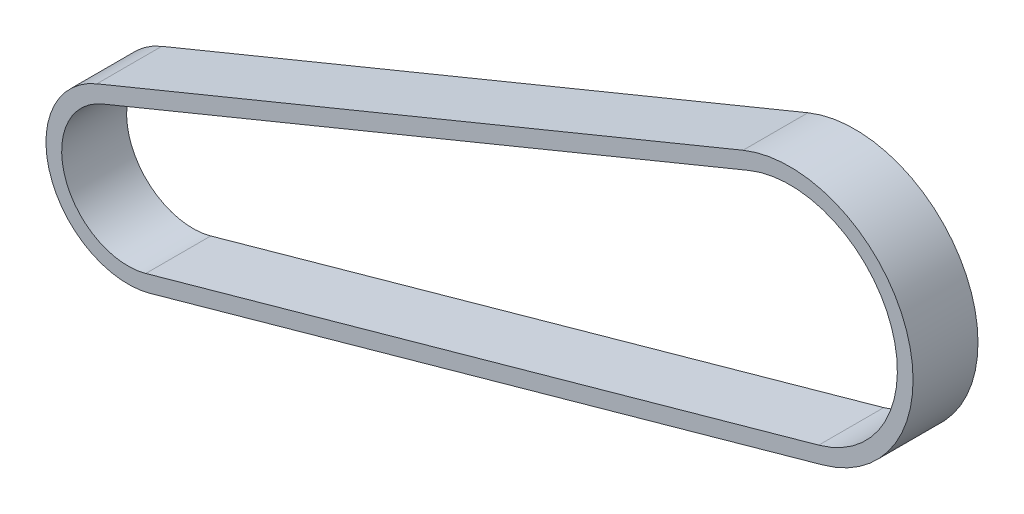
ISO-10303-21;
HEADER;
FILE_DESCRIPTION(('STEP AP214'),'2;1');
FILE_NAME('part.step','',(''),(''),'','','');
FILE_SCHEMA(('AUTOMOTIVE_DESIGN { 1 0 10303 214 1 1 1 1 }'));
ENDSEC;
DATA;
#1=APPLICATION_CONTEXT('core data for automotive mechanical design processes');
#2=APPLICATION_PROTOCOL_DEFINITION('international standard','automotive_design',2000,#1);
#3=PRODUCT_CONTEXT('',#1,'mechanical');
#4=PRODUCT('Part','Part','',(#3));
#5=PRODUCT_RELATED_PRODUCT_CATEGORY('part','',(#4));
#6=PRODUCT_DEFINITION_FORMATION('','',#4);
#7=PRODUCT_DEFINITION_CONTEXT('part definition',#1,'design');
#8=PRODUCT_DEFINITION('design','',#6,#7);
#9=PRODUCT_DEFINITION_SHAPE('','',#8);
#10=(LENGTH_UNIT() NAMED_UNIT(*) SI_UNIT(.MILLI.,.METRE.));
#11=(NAMED_UNIT(*) PLANE_ANGLE_UNIT() SI_UNIT($,.RADIAN.));
#12=(NAMED_UNIT(*) SI_UNIT($,.STERADIAN.) SOLID_ANGLE_UNIT());
#13=UNCERTAINTY_MEASURE_WITH_UNIT(LENGTH_MEASURE(1.E-05),#10,'distance_accuracy_value','');
#14=(GEOMETRIC_REPRESENTATION_CONTEXT(3) GLOBAL_UNCERTAINTY_ASSIGNED_CONTEXT((#13)) GLOBAL_UNIT_ASSIGNED_CONTEXT((#10,
#11,#12)) REPRESENTATION_CONTEXT('',''));
#15=CARTESIAN_POINT('',(0.,0.,0.));
#16=DIRECTION('',(0.,0.,1.));
#17=DIRECTION('',(1.,0.,0.));
#18=AXIS2_PLACEMENT_3D('',#15,#16,#17);
#19=CARTESIAN_POINT('',(-61.1500021896704,-21.0166444834644,0.));
#20=DIRECTION('',(0.,0.,-1.));
#21=DIRECTION('',(-1.,0.,0.));
#22=AXIS2_PLACEMENT_3D('',#19,#20,#21);
#23=CYLINDRICAL_SURFACE('',#22,6.12747048469087);
#24=DIRECTION('',(0.,0.,-1.));
#25=VECTOR('',#24,1.);
#26=CARTESIAN_POINT('',(-59.5028608152974,-26.9185780508291,-3.));
#27=LINE('',#26,#25);
#28=CARTESIAN_POINT('',(-59.5028608152974,-26.9185780508291,3.));
#29=VERTEX_POINT('',#28);
#30=CARTESIAN_POINT('',(-59.5028608152974,-26.9185780508291,-3.));
#31=VERTEX_POINT('',#30);
#32=EDGE_CURVE('E203',#29,#31,#27,.T.);
#33=ORIENTED_EDGE('',*,*,#32,.T.);
#34=CARTESIAN_POINT('',(-61.1500021896704,-21.0166444834644,-3.));
#35=DIRECTION('',(0.,0.,-1.));
#36=DIRECTION('',(-1.,0.,0.));
#37=AXIS2_PLACEMENT_3D('',#34,#35,#36);
#38=CIRCLE('',#37,6.12747048469087);
#39=CARTESIAN_POINT('',(-63.4791691685731,-15.3491162986958,-3.));
#40=VERTEX_POINT('',#39);
#41=EDGE_CURVE('E180',#31,#40,#38,.T.);
#42=ORIENTED_EDGE('',*,*,#41,.T.);
#43=CARTESIAN_POINT('',(-63.4791691685731,-15.3491162986958,3.));
#44=DIRECTION('',(0.,0.,-1.));
#45=VECTOR('',#44,1.);
#46=LINE('',#43,#45);
#47=CARTESIAN_POINT('',(-63.4791691685731,-15.3491162986958,3.));
#48=VERTEX_POINT('',#47);
#49=EDGE_CURVE('E181',#48,#40,#46,.T.);
#50=ORIENTED_EDGE('',*,*,#49,.F.);
#51=CARTESIAN_POINT('',(-61.1500021896704,-21.0166444834644,3.));
#52=DIRECTION('',(0.,0.,-1.));
#53=DIRECTION('',(-1.,0.,0.));
#54=AXIS2_PLACEMENT_3D('',#51,#52,#53);
#55=CIRCLE('',#54,6.12747048469087);
#56=EDGE_CURVE('E44',#29,#48,#55,.T.);
#57=ORIENTED_EDGE('',*,*,#56,.F.);
#58=EDGE_LOOP('',(#33,#42,#50,#57));
#59=FACE_BOUND('',#58,.T.);
#60=ADVANCED_FACE('F35',(#59),#23,.F.);
#61=CARTESIAN_POINT('',(-61.1500021896704,-21.0166444834644,0.));
#62=DIRECTION('',(0.,0.,-1.));
#63=DIRECTION('',(-1.,0.,0.));
#64=AXIS2_PLACEMENT_3D('',#61,#62,#63);
#65=CYLINDRICAL_SURFACE('',#64,7.57747048469087);
#66=DIRECTION('',(0.,0.,1.));
#67=VECTOR('',#66,1.);
#68=CARTESIAN_POINT('',(-59.1130825211697,-28.315207164598,-3.));
#69=LINE('',#68,#67);
#70=CARTESIAN_POINT('',(-59.1130825211697,-28.315207164598,-3.));
#71=VERTEX_POINT('',#70);
#72=CARTESIAN_POINT('',(-59.1130825211697,-28.315207164598,3.));
#73=VERTEX_POINT('',#72);
#74=EDGE_CURVE('E111',#71,#73,#69,.T.);
#75=ORIENTED_EDGE('',*,*,#74,.T.);
#76=CARTESIAN_POINT('',(-61.1500021896704,-21.0166444834644,3.));
#77=DIRECTION('',(0.,0.,-1.));
#78=DIRECTION('',(-1.,0.,0.));
#79=AXIS2_PLACEMENT_3D('',#76,#77,#78);
#80=CIRCLE('',#79,7.57747048469087);
#81=CARTESIAN_POINT('',(-64.0303414880231,-14.0079566980993,3.));
#82=VERTEX_POINT('',#81);
#83=EDGE_CURVE('E11',#73,#82,#80,.T.);
#84=ORIENTED_EDGE('',*,*,#83,.T.);
#85=CARTESIAN_POINT('',(-64.0303414880232,-14.0079566980993,-3.));
#86=DIRECTION('',(0.,0.,1.));
#87=VECTOR('',#86,1.);
#88=LINE('',#85,#87);
#89=CARTESIAN_POINT('',(-64.0303414880231,-14.0079566980993,-3.));
#90=VERTEX_POINT('',#89);
#91=EDGE_CURVE('E52',#90,#82,#88,.T.);
#92=ORIENTED_EDGE('',*,*,#91,.F.);
#93=CARTESIAN_POINT('',(-61.1500021896704,-21.0166444834644,-3.));
#94=DIRECTION('',(0.,0.,-1.));
#95=DIRECTION('',(-1.,0.,0.));
#96=AXIS2_PLACEMENT_3D('',#93,#94,#95);
#97=CIRCLE('',#96,7.57747048469087);
#98=EDGE_CURVE('E173',#71,#90,#97,.T.);
#99=ORIENTED_EDGE('',*,*,#98,.F.);
#100=EDGE_LOOP('',(#75,#84,#92,#99));
#101=FACE_BOUND('',#100,.T.);
#102=ADVANCED_FACE('F164',(#101),#65,.T.);
#103=CARTESIAN_POINT('',(2.67002232681882,-9.56705638109735,-3.));
#104=DIRECTION('',(-0.268812616639839,0.9631924922544,0.));
#105=DIRECTION('',(-0.9631924922544,-0.268812616639839,0.));
#106=AXIS2_PLACEMENT_3D('',#103,#104,#105);
#107=PLANE('',#106);
#108=DIRECTION('',(0.,0.,-1.));
#109=VECTOR('',#108,1.);
#110=CARTESIAN_POINT('',(2.67002232681882,-9.56705638109735,-3.));
#111=LINE('',#110,#109);
#112=CARTESIAN_POINT('',(2.67002232681882,-9.56705638109735,3.));
#113=VERTEX_POINT('',#112);
#114=CARTESIAN_POINT('',(2.67002232681882,-9.56705638109735,-3.));
#115=VERTEX_POINT('',#114);
#116=EDGE_CURVE('E126',#113,#115,#111,.T.);
#117=ORIENTED_EDGE('',*,*,#116,.T.);
#118=DIRECTION('',(-0.963192492254401,-0.268812616639839,0.));
#119=VECTOR('',#118,1.);
#120=CARTESIAN_POINT('',(2.67002232681882,-9.56705638109735,-3.));
#121=LINE('',#120,#119);
#122=EDGE_CURVE('E208',#115,#31,#121,.T.);
#123=ORIENTED_EDGE('',*,*,#122,.T.);
#124=ORIENTED_EDGE('',*,*,#32,.F.);
#125=DIRECTION('',(-0.963192492254401,-0.268812616639839,0.));
#126=VECTOR('',#125,1.);
#127=CARTESIAN_POINT('',(2.67002232681882,-9.56705638109735,3.));
#128=LINE('',#127,#126);
#129=EDGE_CURVE('E329',#113,#29,#128,.T.);
#130=ORIENTED_EDGE('',*,*,#129,.F.);
#131=EDGE_LOOP('',(#117,#123,#124,#130));
#132=FACE_BOUND('',#131,.T.);
#133=ADVANCED_FACE('F161',(#132),#107,.T.);
#134=CARTESIAN_POINT('',(3.05980062094656,-10.9636854948662,-3.));
#135=DIRECTION('',(0.268812616639839,-0.963192492254401,0.));
#136=DIRECTION('',(0.963192492254401,0.268812616639839,0.));
#137=AXIS2_PLACEMENT_3D('',#134,#135,#136);
#138=PLANE('',#137);
#139=DIRECTION('',(0.,0.,1.));
#140=VECTOR('',#139,1.);
#141=CARTESIAN_POINT('',(3.05980062094656,-10.9636854948662,-3.));
#142=LINE('',#141,#140);
#143=CARTESIAN_POINT('',(3.05980062094656,-10.9636854948662,-3.));
#144=VERTEX_POINT('',#143);
#145=CARTESIAN_POINT('',(3.05980062094656,-10.9636854948662,3.));
#146=VERTEX_POINT('',#145);
#147=EDGE_CURVE('E123',#144,#146,#142,.T.);
#148=ORIENTED_EDGE('',*,*,#147,.T.);
#149=DIRECTION('',(-0.963192492254401,-0.268812616639839,0.));
#150=VECTOR('',#149,1.);
#151=CARTESIAN_POINT('',(3.05980062094656,-10.9636854948662,3.));
#152=LINE('',#151,#150);
#153=EDGE_CURVE('E107',#146,#73,#152,.T.);
#154=ORIENTED_EDGE('',*,*,#153,.T.);
#155=ORIENTED_EDGE('',*,*,#74,.F.);
#156=DIRECTION('',(-0.963192492254401,-0.268812616639839,0.));
#157=VECTOR('',#156,1.);
#158=CARTESIAN_POINT('',(3.05980062094656,-10.9636854948662,-3.));
#159=LINE('',#158,#157);
#160=EDGE_CURVE('E325',#144,#71,#159,.T.);
#161=ORIENTED_EDGE('',*,*,#160,.F.);
#162=EDGE_LOOP('',(#148,#154,#155,#161));
#163=FACE_BOUND('',#162,.T.);
#164=ADVANCED_FACE('F157',(#163),#138,.T.);
#165=CARTESIAN_POINT('',(0.,0.,0.));
#166=DIRECTION('',(0.,0.,-1.));
#167=DIRECTION('',(-1.,0.,0.));
#168=AXIS2_PLACEMENT_3D('',#165,#166,#167);
#169=CYLINDRICAL_SURFACE('',#168,9.93265256740648);
#170=DIRECTION('',(0.,0.,-1.));
#171=VECTOR('',#170,1.);
#172=CARTESIAN_POINT('',(-3.77558838197879,9.18708437942492,-3.));
#173=LINE('',#172,#171);
#174=CARTESIAN_POINT('',(-3.77558838197879,9.18708437942492,3.));
#175=VERTEX_POINT('',#174);
#176=CARTESIAN_POINT('',(-3.77558838197879,9.18708437942492,-3.));
#177=VERTEX_POINT('',#176);
#178=EDGE_CURVE('E120',#175,#177,#173,.T.);
#179=ORIENTED_EDGE('',*,*,#178,.T.);
#180=CARTESIAN_POINT('',(0.,0.,-3.));
#181=DIRECTION('',(0.,0.,-1.));
#182=DIRECTION('',(-1.,0.,0.));
#183=AXIS2_PLACEMENT_3D('',#180,#181,#182);
#184=CIRCLE('',#183,9.93265256740648);
#185=EDGE_CURVE('E212',#177,#115,#184,.T.);
#186=ORIENTED_EDGE('',*,*,#185,.T.);
#187=ORIENTED_EDGE('',*,*,#116,.F.);
#188=CARTESIAN_POINT('',(0.,0.,3.));
#189=DIRECTION('',(0.,0.,-1.));
#190=DIRECTION('',(-1.,0.,0.));
#191=AXIS2_PLACEMENT_3D('',#188,#189,#190);
#192=CIRCLE('',#191,9.93265256740648);
#193=EDGE_CURVE('E112',#175,#113,#192,.T.);
#194=ORIENTED_EDGE('',*,*,#193,.F.);
#195=EDGE_LOOP('',(#179,#186,#187,#194));
#196=FACE_BOUND('',#195,.T.);
#197=ADVANCED_FACE('F154',(#196),#169,.F.);
#198=CARTESIAN_POINT('',(0.,0.,0.));
#199=DIRECTION('',(0.,0.,-1.));
#200=DIRECTION('',(-1.,0.,0.));
#201=AXIS2_PLACEMENT_3D('',#198,#199,#200);
#202=CYLINDRICAL_SURFACE('',#201,11.3826525674065);
#203=DIRECTION('',(0.,0.,1.));
#204=VECTOR('',#203,1.);
#205=CARTESIAN_POINT('',(-4.32676070142887,10.5282439800214,-3.));
#206=LINE('',#205,#204);
#207=CARTESIAN_POINT('',(-4.32676070142887,10.5282439800214,-3.));
#208=VERTEX_POINT('',#207);
#209=CARTESIAN_POINT('',(-4.32676070142887,10.5282439800214,3.));
#210=VERTEX_POINT('',#209);
#211=EDGE_CURVE('E115',#208,#210,#206,.T.);
#212=ORIENTED_EDGE('',*,*,#211,.T.);
#213=CARTESIAN_POINT('',(0.,0.,3.));
#214=DIRECTION('',(0.,0.,-1.));
#215=DIRECTION('',(-1.,0.,0.));
#216=AXIS2_PLACEMENT_3D('',#213,#214,#215);
#217=CIRCLE('',#216,11.3826525674065);
#218=EDGE_CURVE('E102',#210,#146,#217,.T.);
#219=ORIENTED_EDGE('',*,*,#218,.T.);
#220=ORIENTED_EDGE('',*,*,#147,.F.);
#221=CARTESIAN_POINT('',(0.,0.,-3.));
#222=DIRECTION('',(0.,0.,-1.));
#223=DIRECTION('',(-1.,0.,0.));
#224=AXIS2_PLACEMENT_3D('',#221,#222,#223);
#225=CIRCLE('',#224,11.3826525674065);
#226=EDGE_CURVE('E118',#208,#144,#225,.T.);
#227=ORIENTED_EDGE('',*,*,#226,.F.);
#228=EDGE_LOOP('',(#212,#219,#220,#227));
#229=FACE_BOUND('',#228,.T.);
#230=ADVANCED_FACE('F116',(#229),#202,.T.);
#231=CARTESIAN_POINT('',(-4.32676070142887,10.5282439800214,-3.));
#232=DIRECTION('',(0.380118841000057,-0.924937655583755,0.));
#233=DIRECTION('',(0.924937655583755,0.380118841000057,0.));
#234=AXIS2_PLACEMENT_3D('',#231,#232,#233);
#235=PLANE('',#234);
#236=ORIENTED_EDGE('',*,*,#91,.T.);
#237=DIRECTION('',(-0.924937655583755,-0.380118841000057,0.));
#238=VECTOR('',#237,1.);
#239=CARTESIAN_POINT('',(-4.32676070142887,10.5282439800214,3.));
#240=LINE('',#239,#238);
#241=EDGE_CURVE('E105',#210,#82,#240,.T.);
#242=ORIENTED_EDGE('',*,*,#241,.F.);
#243=ORIENTED_EDGE('',*,*,#211,.F.);
#244=DIRECTION('',(-0.924937655583755,-0.380118841000057,0.));
#245=VECTOR('',#244,1.);
#246=CARTESIAN_POINT('',(-4.32676070142887,10.5282439800214,-3.));
#247=LINE('',#246,#245);
#248=EDGE_CURVE('E140',#208,#90,#247,.T.);
#249=ORIENTED_EDGE('',*,*,#248,.T.);
#250=EDGE_LOOP('',(#236,#242,#243,#249));
#251=FACE_BOUND('',#250,.T.);
#252=ADVANCED_FACE('F122',(#251),#235,.F.);
#253=CARTESIAN_POINT('',(-4.32676070142887,10.5282439800214,3.));
#254=DIRECTION('',(0.,0.,-1.));
#255=DIRECTION('',(-1.,0.,0.));
#256=AXIS2_PLACEMENT_3D('',#253,#254,#255);
#257=PLANE('',#256);
#258=DIRECTION('',(-0.924937655583755,-0.380118841000057,0.));
#259=VECTOR('',#258,1.);
#260=CARTESIAN_POINT('',(-3.77558838197879,9.18708437942492,3.));
#261=LINE('',#260,#259);
#262=EDGE_CURVE('E124',#175,#48,#261,.T.);
#263=ORIENTED_EDGE('',*,*,#262,.F.);
#264=ORIENTED_EDGE('',*,*,#193,.T.);
#265=ORIENTED_EDGE('',*,*,#129,.T.);
#266=ORIENTED_EDGE('',*,*,#56,.T.);
#267=EDGE_LOOP('',(#263,#264,#265,#266));
#268=FACE_BOUND('',#267,.T.);
#269=ORIENTED_EDGE('',*,*,#241,.T.);
#270=ORIENTED_EDGE('',*,*,#83,.F.);
#271=ORIENTED_EDGE('',*,*,#153,.F.);
#272=ORIENTED_EDGE('',*,*,#218,.F.);
#273=EDGE_LOOP('',(#269,#270,#271,#272));
#274=FACE_BOUND('',#273,.T.);
#275=ADVANCED_FACE('F104',(#268,#274),#257,.F.);
#276=CARTESIAN_POINT('',(-3.77558838197879,9.18708437942492,-3.));
#277=DIRECTION('',(-0.380118841000057,0.924937655583755,0.));
#278=DIRECTION('',(-0.924937655583755,-0.380118841000057,0.));
#279=AXIS2_PLACEMENT_3D('',#276,#277,#278);
#280=PLANE('',#279);
#281=ORIENTED_EDGE('',*,*,#49,.T.);
#282=DIRECTION('',(-0.924937655583755,-0.380118841000057,0.));
#283=VECTOR('',#282,1.);
#284=CARTESIAN_POINT('',(-3.77558838197879,9.18708437942492,-3.));
#285=LINE('',#284,#283);
#286=EDGE_CURVE('E128',#177,#40,#285,.T.);
#287=ORIENTED_EDGE('',*,*,#286,.F.);
#288=ORIENTED_EDGE('',*,*,#178,.F.);
#289=ORIENTED_EDGE('',*,*,#262,.T.);
#290=EDGE_LOOP('',(#281,#287,#288,#289));
#291=FACE_BOUND('',#290,.T.);
#292=ADVANCED_FACE('F221',(#291),#280,.F.);
#293=CARTESIAN_POINT('',(-4.32676070142887,10.5282439800214,-3.));
#294=DIRECTION('',(0.,0.,1.));
#295=DIRECTION('',(0.,-1.,0.));
#296=AXIS2_PLACEMENT_3D('',#293,#294,#295);
#297=PLANE('',#296);
#298=ORIENTED_EDGE('',*,*,#248,.F.);
#299=ORIENTED_EDGE('',*,*,#226,.T.);
#300=ORIENTED_EDGE('',*,*,#160,.T.);
#301=ORIENTED_EDGE('',*,*,#98,.T.);
#302=EDGE_LOOP('',(#298,#299,#300,#301));
#303=FACE_BOUND('',#302,.T.);
#304=ORIENTED_EDGE('',*,*,#286,.T.);
#305=ORIENTED_EDGE('',*,*,#41,.F.);
#306=ORIENTED_EDGE('',*,*,#122,.F.);
#307=ORIENTED_EDGE('',*,*,#185,.F.);
#308=EDGE_LOOP('',(#304,#305,#306,#307));
#309=FACE_BOUND('',#308,.T.);
#310=ADVANCED_FACE('F207',(#303,#309),#297,.F.);
#311=CLOSED_SHELL('',(#60,#102,#133,#164,#197,#230,#252,#275,#292,#310));
#312=MANIFOLD_SOLID_BREP('B2',#311);
#313=ADVANCED_BREP_SHAPE_REPRESENTATION('',(#18,#312),#14);
#314=SHAPE_DEFINITION_REPRESENTATION(#9,#313);
ENDSEC;
END-ISO-10303-21;
